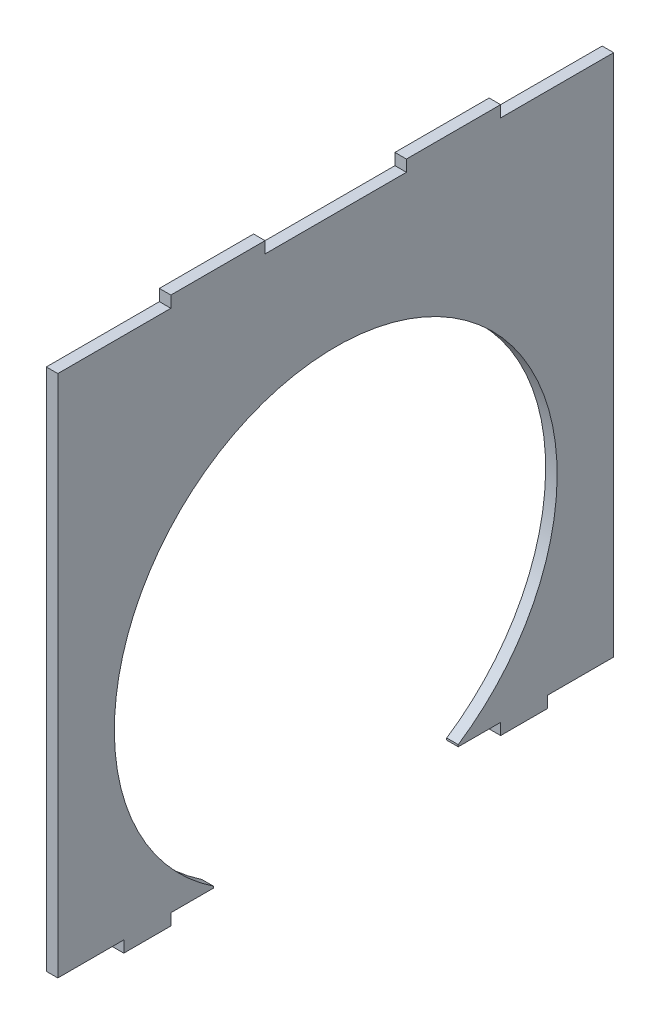
ISO-10303-21;
HEADER;
FILE_DESCRIPTION(('STEP AP214'),'2;1');
FILE_NAME('part.step','',(''),(''),'','','');
FILE_SCHEMA(('AUTOMOTIVE_DESIGN { 1 0 10303 214 1 1 1 1 }'));
ENDSEC;
DATA;
#1=APPLICATION_CONTEXT('core data for automotive mechanical design processes');
#2=APPLICATION_PROTOCOL_DEFINITION('international standard','automotive_design',2000,#1);
#3=PRODUCT_CONTEXT('',#1,'mechanical');
#4=PRODUCT('Part','Part','',(#3));
#5=PRODUCT_RELATED_PRODUCT_CATEGORY('part','',(#4));
#6=PRODUCT_DEFINITION_FORMATION('','',#4);
#7=PRODUCT_DEFINITION_CONTEXT('part definition',#1,'design');
#8=PRODUCT_DEFINITION('design','',#6,#7);
#9=PRODUCT_DEFINITION_SHAPE('','',#8);
#10=(LENGTH_UNIT() NAMED_UNIT(*) SI_UNIT(.MILLI.,.METRE.));
#11=(NAMED_UNIT(*) PLANE_ANGLE_UNIT() SI_UNIT($,.RADIAN.));
#12=(NAMED_UNIT(*) SI_UNIT($,.STERADIAN.) SOLID_ANGLE_UNIT());
#13=UNCERTAINTY_MEASURE_WITH_UNIT(LENGTH_MEASURE(1.E-05),#10,'distance_accuracy_value','');
#14=(GEOMETRIC_REPRESENTATION_CONTEXT(3) GLOBAL_UNCERTAINTY_ASSIGNED_CONTEXT((#13)) GLOBAL_UNIT_ASSIGNED_CONTEXT((#10,
#11,#12)) REPRESENTATION_CONTEXT('',''));
#15=CARTESIAN_POINT('',(0.,0.,0.));
#16=DIRECTION('',(0.,0.,1.));
#17=DIRECTION('',(1.,0.,0.));
#18=AXIS2_PLACEMENT_3D('',#15,#16,#17);
#19=CARTESIAN_POINT('',(2.44,55.56,-34.9999999999999));
#20=DIRECTION('',(0.,-1.,0.));
#21=DIRECTION('',(0.,0.,-1.));
#22=AXIS2_PLACEMENT_3D('',#19,#20,#21);
#23=PLANE('',#22);
#24=DIRECTION('',(0.,0.,1.));
#25=VECTOR('',#24,1.);
#26=CARTESIAN_POINT('',(0.,55.56,-34.9999999999999));
#27=LINE('',#26,#25);
#28=CARTESIAN_POINT('',(0.,55.56,-59.));
#29=VERTEX_POINT('',#28);
#30=CARTESIAN_POINT('',(0.,55.56,-34.9999999999999));
#31=VERTEX_POINT('',#30);
#32=EDGE_CURVE('E226',#29,#31,#27,.T.);
#33=ORIENTED_EDGE('',*,*,#32,.T.);
#34=DIRECTION('',(-1.,0.,0.));
#35=VECTOR('',#34,1.);
#36=CARTESIAN_POINT('',(2.44,55.56,-34.9999999999999));
#37=LINE('',#36,#35);
#38=CARTESIAN_POINT('',(2.44,55.56,-34.9999999999999));
#39=VERTEX_POINT('',#38);
#40=EDGE_CURVE('E11',#39,#31,#37,.T.);
#41=ORIENTED_EDGE('',*,*,#40,.F.);
#42=DIRECTION('',(0.,0.,1.));
#43=VECTOR('',#42,1.);
#44=CARTESIAN_POINT('',(2.44,55.56,-34.9999999999999));
#45=LINE('',#44,#43);
#46=CARTESIAN_POINT('',(2.44,55.56,-59.));
#47=VERTEX_POINT('',#46);
#48=EDGE_CURVE('E272',#47,#39,#45,.T.);
#49=ORIENTED_EDGE('',*,*,#48,.F.);
#50=DIRECTION('',(-1.,0.,0.));
#51=VECTOR('',#50,1.);
#52=CARTESIAN_POINT('',(2.44,55.56,-59.));
#53=LINE('',#52,#51);
#54=EDGE_CURVE('E222',#47,#29,#53,.T.);
#55=ORIENTED_EDGE('',*,*,#54,.T.);
#56=EDGE_LOOP('',(#33,#41,#49,#55));
#57=FACE_BOUND('',#56,.T.);
#58=ADVANCED_FACE('F34',(#57),#23,.F.);
#59=CARTESIAN_POINT('',(2.44,58.,-34.9999999999999));
#60=DIRECTION('',(0.,0.,1.));
#61=DIRECTION('',(1.,0.,0.));
#62=AXIS2_PLACEMENT_3D('',#59,#60,#61);
#63=PLANE('',#62);
#64=DIRECTION('',(0.,1.,0.));
#65=VECTOR('',#64,1.);
#66=CARTESIAN_POINT('',(0.,58.,-34.9999999999999));
#67=LINE('',#66,#65);
#68=CARTESIAN_POINT('',(0.,58.,-34.9999999999999));
#69=VERTEX_POINT('',#68);
#70=EDGE_CURVE('E229',#31,#69,#67,.T.);
#71=ORIENTED_EDGE('',*,*,#70,.T.);
#72=DIRECTION('',(-1.,0.,0.));
#73=VECTOR('',#72,1.);
#74=CARTESIAN_POINT('',(2.44,58.,-34.9999999999999));
#75=LINE('',#74,#73);
#76=CARTESIAN_POINT('',(2.44,58.,-34.9999999999999));
#77=VERTEX_POINT('',#76);
#78=EDGE_CURVE('E42',#77,#69,#75,.T.);
#79=ORIENTED_EDGE('',*,*,#78,.F.);
#80=DIRECTION('',(0.,1.,0.));
#81=VECTOR('',#80,1.);
#82=CARTESIAN_POINT('',(2.44,58.,-34.9999999999999));
#83=LINE('',#82,#81);
#84=EDGE_CURVE('E141',#39,#77,#83,.T.);
#85=ORIENTED_EDGE('',*,*,#84,.F.);
#86=ORIENTED_EDGE('',*,*,#40,.T.);
#87=EDGE_LOOP('',(#71,#79,#85,#86));
#88=FACE_BOUND('',#87,.T.);
#89=ADVANCED_FACE('F410',(#88),#63,.F.);
#90=CARTESIAN_POINT('',(2.44,58.,-34.9999999999999));
#91=DIRECTION('',(0.,-1.,0.));
#92=DIRECTION('',(0.,0.,-1.));
#93=AXIS2_PLACEMENT_3D('',#90,#91,#92);
#94=PLANE('',#93);
#95=DIRECTION('',(0.,0.,1.));
#96=VECTOR('',#95,1.);
#97=CARTESIAN_POINT('',(0.,58.,-34.9999999999999));
#98=LINE('',#97,#96);
#99=CARTESIAN_POINT('',(0.,58.,-14.9999999999999));
#100=VERTEX_POINT('',#99);
#101=EDGE_CURVE('E231',#69,#100,#98,.T.);
#102=ORIENTED_EDGE('',*,*,#101,.T.);
#103=DIRECTION('',(-1.,0.,0.));
#104=VECTOR('',#103,1.);
#105=CARTESIAN_POINT('',(2.44,58.,-14.9999999999999));
#106=LINE('',#105,#104);
#107=CARTESIAN_POINT('',(2.44,58.,-14.9999999999999));
#108=VERTEX_POINT('',#107);
#109=EDGE_CURVE('E327',#108,#100,#106,.T.);
#110=ORIENTED_EDGE('',*,*,#109,.F.);
#111=DIRECTION('',(0.,0.,1.));
#112=VECTOR('',#111,1.);
#113=CARTESIAN_POINT('',(2.44,58.,-34.9999999999999));
#114=LINE('',#113,#112);
#115=EDGE_CURVE('E335',#77,#108,#114,.T.);
#116=ORIENTED_EDGE('',*,*,#115,.F.);
#117=ORIENTED_EDGE('',*,*,#78,.T.);
#118=EDGE_LOOP('',(#102,#110,#116,#117));
#119=FACE_BOUND('',#118,.T.);
#120=ADVANCED_FACE('F333',(#119),#94,.F.);
#121=CARTESIAN_POINT('',(2.44,58.,-14.9999999999999));
#122=DIRECTION('',(0.,0.,-1.));
#123=DIRECTION('',(0.,1.,0.));
#124=AXIS2_PLACEMENT_3D('',#121,#122,#123);
#125=PLANE('',#124);
#126=DIRECTION('',(0.,-1.,0.));
#127=VECTOR('',#126,1.);
#128=CARTESIAN_POINT('',(0.,58.,-14.9999999999999));
#129=LINE('',#128,#127);
#130=CARTESIAN_POINT('',(0.,55.56,-14.9999999999999));
#131=VERTEX_POINT('',#130);
#132=EDGE_CURVE('E233',#100,#131,#129,.T.);
#133=ORIENTED_EDGE('',*,*,#132,.T.);
#134=DIRECTION('',(-1.,0.,0.));
#135=VECTOR('',#134,1.);
#136=CARTESIAN_POINT('',(2.44,55.56,-14.9999999999999));
#137=LINE('',#136,#135);
#138=CARTESIAN_POINT('',(2.44,55.56,-14.9999999999999));
#139=VERTEX_POINT('',#138);
#140=EDGE_CURVE('E324',#139,#131,#137,.T.);
#141=ORIENTED_EDGE('',*,*,#140,.F.);
#142=DIRECTION('',(0.,-1.,0.));
#143=VECTOR('',#142,1.);
#144=CARTESIAN_POINT('',(2.44,58.,-14.9999999999999));
#145=LINE('',#144,#143);
#146=EDGE_CURVE('E353',#108,#139,#145,.T.);
#147=ORIENTED_EDGE('',*,*,#146,.F.);
#148=ORIENTED_EDGE('',*,*,#109,.T.);
#149=EDGE_LOOP('',(#133,#141,#147,#148));
#150=FACE_BOUND('',#149,.T.);
#151=ADVANCED_FACE('F344',(#150),#125,.F.);
#152=CARTESIAN_POINT('',(2.44,55.56,15.));
#153=DIRECTION('',(0.,-1.,0.));
#154=DIRECTION('',(0.,0.,-1.));
#155=AXIS2_PLACEMENT_3D('',#152,#153,#154);
#156=PLANE('',#155);
#157=DIRECTION('',(0.,0.,1.));
#158=VECTOR('',#157,1.);
#159=CARTESIAN_POINT('',(0.,55.56,15.));
#160=LINE('',#159,#158);
#161=CARTESIAN_POINT('',(0.,55.56,15.));
#162=VERTEX_POINT('',#161);
#163=EDGE_CURVE('E235',#131,#162,#160,.T.);
#164=ORIENTED_EDGE('',*,*,#163,.T.);
#165=DIRECTION('',(-1.,0.,0.));
#166=VECTOR('',#165,1.);
#167=CARTESIAN_POINT('',(2.44,55.56,15.));
#168=LINE('',#167,#166);
#169=CARTESIAN_POINT('',(2.44,55.56,15.));
#170=VERTEX_POINT('',#169);
#171=EDGE_CURVE('E321',#170,#162,#168,.T.);
#172=ORIENTED_EDGE('',*,*,#171,.F.);
#173=DIRECTION('',(0.,0.,1.));
#174=VECTOR('',#173,1.);
#175=CARTESIAN_POINT('',(2.44,55.56,15.));
#176=LINE('',#175,#174);
#177=EDGE_CURVE('E350',#139,#170,#176,.T.);
#178=ORIENTED_EDGE('',*,*,#177,.F.);
#179=ORIENTED_EDGE('',*,*,#140,.T.);
#180=EDGE_LOOP('',(#164,#172,#178,#179));
#181=FACE_BOUND('',#180,.T.);
#182=ADVANCED_FACE('F348',(#181),#156,.F.);
#183=CARTESIAN_POINT('',(2.44,58.,15.));
#184=DIRECTION('',(0.,0.,1.));
#185=DIRECTION('',(0.,-1.,0.));
#186=AXIS2_PLACEMENT_3D('',#183,#184,#185);
#187=PLANE('',#186);
#188=DIRECTION('',(0.,1.,0.));
#189=VECTOR('',#188,1.);
#190=CARTESIAN_POINT('',(0.,58.,15.));
#191=LINE('',#190,#189);
#192=CARTESIAN_POINT('',(0.,58.,15.));
#193=VERTEX_POINT('',#192);
#194=EDGE_CURVE('E237',#162,#193,#191,.T.);
#195=ORIENTED_EDGE('',*,*,#194,.T.);
#196=DIRECTION('',(-1.,0.,0.));
#197=VECTOR('',#196,1.);
#198=CARTESIAN_POINT('',(2.44,58.,15.));
#199=LINE('',#198,#197);
#200=CARTESIAN_POINT('',(2.44,58.,15.));
#201=VERTEX_POINT('',#200);
#202=EDGE_CURVE('E318',#201,#193,#199,.T.);
#203=ORIENTED_EDGE('',*,*,#202,.F.);
#204=DIRECTION('',(0.,1.,0.));
#205=VECTOR('',#204,1.);
#206=CARTESIAN_POINT('',(2.44,58.,15.));
#207=LINE('',#206,#205);
#208=EDGE_CURVE('E352',#170,#201,#207,.T.);
#209=ORIENTED_EDGE('',*,*,#208,.F.);
#210=ORIENTED_EDGE('',*,*,#171,.T.);
#211=EDGE_LOOP('',(#195,#203,#209,#210));
#212=FACE_BOUND('',#211,.T.);
#213=ADVANCED_FACE('F423',(#212),#187,.F.);
#214=CARTESIAN_POINT('',(2.44,58.,35.));
#215=DIRECTION('',(0.,-1.,0.));
#216=DIRECTION('',(0.,0.,-1.));
#217=AXIS2_PLACEMENT_3D('',#214,#215,#216);
#218=PLANE('',#217);
#219=DIRECTION('',(0.,0.,1.));
#220=VECTOR('',#219,1.);
#221=CARTESIAN_POINT('',(0.,58.,35.));
#222=LINE('',#221,#220);
#223=CARTESIAN_POINT('',(0.,58.,35.));
#224=VERTEX_POINT('',#223);
#225=EDGE_CURVE('E239',#193,#224,#222,.T.);
#226=ORIENTED_EDGE('',*,*,#225,.T.);
#227=DIRECTION('',(-1.,0.,0.));
#228=VECTOR('',#227,1.);
#229=CARTESIAN_POINT('',(2.44,58.,35.));
#230=LINE('',#229,#228);
#231=CARTESIAN_POINT('',(2.44,58.,35.));
#232=VERTEX_POINT('',#231);
#233=EDGE_CURVE('E315',#232,#224,#230,.T.);
#234=ORIENTED_EDGE('',*,*,#233,.F.);
#235=DIRECTION('',(0.,0.,1.));
#236=VECTOR('',#235,1.);
#237=CARTESIAN_POINT('',(2.44,58.,35.));
#238=LINE('',#237,#236);
#239=EDGE_CURVE('E355',#201,#232,#238,.T.);
#240=ORIENTED_EDGE('',*,*,#239,.F.);
#241=ORIENTED_EDGE('',*,*,#202,.T.);
#242=EDGE_LOOP('',(#226,#234,#240,#241));
#243=FACE_BOUND('',#242,.T.);
#244=ADVANCED_FACE('F426',(#243),#218,.F.);
#245=CARTESIAN_POINT('',(2.44,58.,35.));
#246=DIRECTION('',(0.,0.,-1.));
#247=DIRECTION('',(-1.,0.,0.));
#248=AXIS2_PLACEMENT_3D('',#245,#246,#247);
#249=PLANE('',#248);
#250=DIRECTION('',(0.,-1.,0.));
#251=VECTOR('',#250,1.);
#252=CARTESIAN_POINT('',(0.,58.,35.));
#253=LINE('',#252,#251);
#254=CARTESIAN_POINT('',(0.,55.56,35.));
#255=VERTEX_POINT('',#254);
#256=EDGE_CURVE('E241',#224,#255,#253,.T.);
#257=ORIENTED_EDGE('',*,*,#256,.T.);
#258=DIRECTION('',(-1.,0.,0.));
#259=VECTOR('',#258,1.);
#260=CARTESIAN_POINT('',(2.44,55.56,35.));
#261=LINE('',#260,#259);
#262=CARTESIAN_POINT('',(2.44,55.56,35.));
#263=VERTEX_POINT('',#262);
#264=EDGE_CURVE('E312',#263,#255,#261,.T.);
#265=ORIENTED_EDGE('',*,*,#264,.F.);
#266=DIRECTION('',(0.,-1.,0.));
#267=VECTOR('',#266,1.);
#268=CARTESIAN_POINT('',(2.44,58.,35.));
#269=LINE('',#268,#267);
#270=EDGE_CURVE('E361',#232,#263,#269,.T.);
#271=ORIENTED_EDGE('',*,*,#270,.F.);
#272=ORIENTED_EDGE('',*,*,#233,.T.);
#273=EDGE_LOOP('',(#257,#265,#271,#272));
#274=FACE_BOUND('',#273,.T.);
#275=ADVANCED_FACE('F430',(#274),#249,.F.);
#276=CARTESIAN_POINT('',(2.44,55.56,59.));
#277=DIRECTION('',(0.,-1.,0.));
#278=DIRECTION('',(0.,0.,-1.));
#279=AXIS2_PLACEMENT_3D('',#276,#277,#278);
#280=PLANE('',#279);
#281=DIRECTION('',(0.,0.,1.));
#282=VECTOR('',#281,1.);
#283=CARTESIAN_POINT('',(0.,55.56,59.));
#284=LINE('',#283,#282);
#285=CARTESIAN_POINT('',(0.,55.56,59.));
#286=VERTEX_POINT('',#285);
#287=EDGE_CURVE('E243',#255,#286,#284,.T.);
#288=ORIENTED_EDGE('',*,*,#287,.T.);
#289=DIRECTION('',(-1.,0.,0.));
#290=VECTOR('',#289,1.);
#291=CARTESIAN_POINT('',(2.44,55.56,59.));
#292=LINE('',#291,#290);
#293=CARTESIAN_POINT('',(2.44,55.56,59.));
#294=VERTEX_POINT('',#293);
#295=EDGE_CURVE('E309',#294,#286,#292,.T.);
#296=ORIENTED_EDGE('',*,*,#295,.F.);
#297=DIRECTION('',(0.,0.,1.));
#298=VECTOR('',#297,1.);
#299=CARTESIAN_POINT('',(2.44,55.56,59.));
#300=LINE('',#299,#298);
#301=EDGE_CURVE('E363',#263,#294,#300,.T.);
#302=ORIENTED_EDGE('',*,*,#301,.F.);
#303=ORIENTED_EDGE('',*,*,#264,.T.);
#304=EDGE_LOOP('',(#288,#296,#302,#303));
#305=FACE_BOUND('',#304,.T.);
#306=ADVANCED_FACE('F434',(#305),#280,.F.);
#307=CARTESIAN_POINT('',(2.44,-55.56,59.));
#308=DIRECTION('',(0.,0.,-1.));
#309=DIRECTION('',(-1.,0.,0.));
#310=AXIS2_PLACEMENT_3D('',#307,#308,#309);
#311=PLANE('',#310);
#312=DIRECTION('',(0.,-1.,0.));
#313=VECTOR('',#312,1.);
#314=CARTESIAN_POINT('',(0.,-55.56,59.));
#315=LINE('',#314,#313);
#316=CARTESIAN_POINT('',(0.,-55.56,59.));
#317=VERTEX_POINT('',#316);
#318=EDGE_CURVE('E245',#286,#317,#315,.T.);
#319=ORIENTED_EDGE('',*,*,#318,.T.);
#320=DIRECTION('',(-1.,0.,0.));
#321=VECTOR('',#320,1.);
#322=CARTESIAN_POINT('',(2.44,-55.56,59.));
#323=LINE('',#322,#321);
#324=CARTESIAN_POINT('',(2.44,-55.56,59.));
#325=VERTEX_POINT('',#324);
#326=EDGE_CURVE('E306',#325,#317,#323,.T.);
#327=ORIENTED_EDGE('',*,*,#326,.F.);
#328=DIRECTION('',(0.,-1.,0.));
#329=VECTOR('',#328,1.);
#330=CARTESIAN_POINT('',(2.44,-55.56,59.));
#331=LINE('',#330,#329);
#332=EDGE_CURVE('E365',#294,#325,#331,.T.);
#333=ORIENTED_EDGE('',*,*,#332,.F.);
#334=ORIENTED_EDGE('',*,*,#295,.T.);
#335=EDGE_LOOP('',(#319,#327,#333,#334));
#336=FACE_BOUND('',#335,.T.);
#337=ADVANCED_FACE('F438',(#336),#311,.F.);
#338=CARTESIAN_POINT('',(2.44,-55.56,59.));
#339=DIRECTION('',(0.,1.,0.));
#340=DIRECTION('',(0.,0.,1.));
#341=AXIS2_PLACEMENT_3D('',#338,#339,#340);
#342=PLANE('',#341);
#343=DIRECTION('',(0.,0.,-1.));
#344=VECTOR('',#343,1.);
#345=CARTESIAN_POINT('',(0.,-55.56,59.));
#346=LINE('',#345,#344);
#347=CARTESIAN_POINT('',(0.,-55.56,45.));
#348=VERTEX_POINT('',#347);
#349=EDGE_CURVE('E247',#317,#348,#346,.T.);
#350=ORIENTED_EDGE('',*,*,#349,.T.);
#351=DIRECTION('',(-1.,0.,0.));
#352=VECTOR('',#351,1.);
#353=CARTESIAN_POINT('',(2.44,-55.56,45.));
#354=LINE('',#353,#352);
#355=CARTESIAN_POINT('',(2.44,-55.56,45.));
#356=VERTEX_POINT('',#355);
#357=EDGE_CURVE('E303',#356,#348,#354,.T.);
#358=ORIENTED_EDGE('',*,*,#357,.F.);
#359=DIRECTION('',(0.,0.,-1.));
#360=VECTOR('',#359,1.);
#361=CARTESIAN_POINT('',(2.44,-55.56,59.));
#362=LINE('',#361,#360);
#363=EDGE_CURVE('E367',#325,#356,#362,.T.);
#364=ORIENTED_EDGE('',*,*,#363,.F.);
#365=ORIENTED_EDGE('',*,*,#326,.T.);
#366=EDGE_LOOP('',(#350,#358,#364,#365));
#367=FACE_BOUND('',#366,.T.);
#368=ADVANCED_FACE('F442',(#367),#342,.F.);
#369=CARTESIAN_POINT('',(2.44,-58.,45.));
#370=DIRECTION('',(0.,0.,-1.));
#371=DIRECTION('',(-1.,0.,0.));
#372=AXIS2_PLACEMENT_3D('',#369,#370,#371);
#373=PLANE('',#372);
#374=DIRECTION('',(0.,-1.,0.));
#375=VECTOR('',#374,1.);
#376=CARTESIAN_POINT('',(0.,-58.,45.));
#377=LINE('',#376,#375);
#378=CARTESIAN_POINT('',(0.,-58.,45.));
#379=VERTEX_POINT('',#378);
#380=EDGE_CURVE('E249',#348,#379,#377,.T.);
#381=ORIENTED_EDGE('',*,*,#380,.T.);
#382=DIRECTION('',(-1.,0.,0.));
#383=VECTOR('',#382,1.);
#384=CARTESIAN_POINT('',(2.44,-58.,45.));
#385=LINE('',#384,#383);
#386=CARTESIAN_POINT('',(2.44,-58.,45.));
#387=VERTEX_POINT('',#386);
#388=EDGE_CURVE('E300',#387,#379,#385,.T.);
#389=ORIENTED_EDGE('',*,*,#388,.F.);
#390=DIRECTION('',(0.,-1.,0.));
#391=VECTOR('',#390,1.);
#392=CARTESIAN_POINT('',(2.44,-58.,45.));
#393=LINE('',#392,#391);
#394=EDGE_CURVE('E369',#356,#387,#393,.T.);
#395=ORIENTED_EDGE('',*,*,#394,.F.);
#396=ORIENTED_EDGE('',*,*,#357,.T.);
#397=EDGE_LOOP('',(#381,#389,#395,#396));
#398=FACE_BOUND('',#397,.T.);
#399=ADVANCED_FACE('F446',(#398),#373,.F.);
#400=CARTESIAN_POINT('',(2.44,-58.,35.));
#401=DIRECTION('',(0.,1.,0.));
#402=DIRECTION('',(0.,0.,1.));
#403=AXIS2_PLACEMENT_3D('',#400,#401,#402);
#404=PLANE('',#403);
#405=DIRECTION('',(0.,0.,-1.));
#406=VECTOR('',#405,1.);
#407=CARTESIAN_POINT('',(0.,-58.,35.));
#408=LINE('',#407,#406);
#409=CARTESIAN_POINT('',(0.,-58.,35.));
#410=VERTEX_POINT('',#409);
#411=EDGE_CURVE('E251',#379,#410,#408,.T.);
#412=ORIENTED_EDGE('',*,*,#411,.T.);
#413=DIRECTION('',(-1.,0.,0.));
#414=VECTOR('',#413,1.);
#415=CARTESIAN_POINT('',(2.44,-58.,35.));
#416=LINE('',#415,#414);
#417=CARTESIAN_POINT('',(2.44,-58.,35.));
#418=VERTEX_POINT('',#417);
#419=EDGE_CURVE('E297',#418,#410,#416,.T.);
#420=ORIENTED_EDGE('',*,*,#419,.F.);
#421=DIRECTION('',(0.,0.,-1.));
#422=VECTOR('',#421,1.);
#423=CARTESIAN_POINT('',(2.44,-58.,35.));
#424=LINE('',#423,#422);
#425=EDGE_CURVE('E371',#387,#418,#424,.T.);
#426=ORIENTED_EDGE('',*,*,#425,.F.);
#427=ORIENTED_EDGE('',*,*,#388,.T.);
#428=EDGE_LOOP('',(#412,#420,#426,#427));
#429=FACE_BOUND('',#428,.T.);
#430=ADVANCED_FACE('F450',(#429),#404,.F.);
#431=CARTESIAN_POINT('',(2.44,-58.,35.));
#432=DIRECTION('',(0.,0.,1.));
#433=DIRECTION('',(1.,0.,0.));
#434=AXIS2_PLACEMENT_3D('',#431,#432,#433);
#435=PLANE('',#434);
#436=DIRECTION('',(0.,1.,0.));
#437=VECTOR('',#436,1.);
#438=CARTESIAN_POINT('',(0.,-58.,35.));
#439=LINE('',#438,#437);
#440=CARTESIAN_POINT('',(0.,-55.56,35.));
#441=VERTEX_POINT('',#440);
#442=EDGE_CURVE('E253',#410,#441,#439,.T.);
#443=ORIENTED_EDGE('',*,*,#442,.T.);
#444=DIRECTION('',(-1.,0.,0.));
#445=VECTOR('',#444,1.);
#446=CARTESIAN_POINT('',(2.44,-55.56,35.));
#447=LINE('',#446,#445);
#448=CARTESIAN_POINT('',(2.44,-55.56,35.));
#449=VERTEX_POINT('',#448);
#450=EDGE_CURVE('E294',#449,#441,#447,.T.);
#451=ORIENTED_EDGE('',*,*,#450,.F.);
#452=DIRECTION('',(0.,1.,0.));
#453=VECTOR('',#452,1.);
#454=CARTESIAN_POINT('',(2.44,-58.,35.));
#455=LINE('',#454,#453);
#456=EDGE_CURVE('E373',#418,#449,#455,.T.);
#457=ORIENTED_EDGE('',*,*,#456,.F.);
#458=ORIENTED_EDGE('',*,*,#419,.T.);
#459=EDGE_LOOP('',(#443,#451,#457,#458));
#460=FACE_BOUND('',#459,.T.);
#461=ADVANCED_FACE('F454',(#460),#435,.F.);
#462=CARTESIAN_POINT('',(2.44,-55.56,35.));
#463=DIRECTION('',(0.,1.,0.));
#464=DIRECTION('',(0.,0.,1.));
#465=AXIS2_PLACEMENT_3D('',#462,#463,#464);
#466=PLANE('',#465);
#467=DIRECTION('',(0.,0.,-1.));
#468=VECTOR('',#467,1.);
#469=CARTESIAN_POINT('',(0.,-55.56,35.));
#470=LINE('',#469,#468);
#471=CARTESIAN_POINT('',(0.,-55.56,26.));
#472=VERTEX_POINT('',#471);
#473=EDGE_CURVE('E255',#441,#472,#470,.T.);
#474=ORIENTED_EDGE('',*,*,#473,.T.);
#475=DIRECTION('',(-1.,0.,0.));
#476=VECTOR('',#475,1.);
#477=CARTESIAN_POINT('',(2.44,-55.56,26.));
#478=LINE('',#477,#476);
#479=CARTESIAN_POINT('',(2.44,-55.56,26.));
#480=VERTEX_POINT('',#479);
#481=EDGE_CURVE('E291',#480,#472,#478,.T.);
#482=ORIENTED_EDGE('',*,*,#481,.F.);
#483=DIRECTION('',(0.,0.,-1.));
#484=VECTOR('',#483,1.);
#485=CARTESIAN_POINT('',(2.44,-55.56,35.));
#486=LINE('',#485,#484);
#487=EDGE_CURVE('E375',#449,#480,#486,.T.);
#488=ORIENTED_EDGE('',*,*,#487,.F.);
#489=ORIENTED_EDGE('',*,*,#450,.T.);
#490=EDGE_LOOP('',(#474,#482,#488,#489));
#491=FACE_BOUND('',#490,.T.);
#492=ADVANCED_FACE('F458',(#491),#466,.F.);
#493=CARTESIAN_POINT('',(2.44,-55.56,26.));
#494=DIRECTION('',(0.,0.,1.));
#495=DIRECTION('',(0.,-1.,0.));
#496=AXIS2_PLACEMENT_3D('',#493,#494,#495);
#497=PLANE('',#496);
#498=DIRECTION('',(0.,1.,0.));
#499=VECTOR('',#498,1.);
#500=CARTESIAN_POINT('',(0.,-55.56,26.));
#501=LINE('',#500,#499);
#502=CARTESIAN_POINT('',(0.,-55.1535439009038,26.));
#503=VERTEX_POINT('',#502);
#504=EDGE_CURVE('E257',#472,#503,#501,.T.);
#505=ORIENTED_EDGE('',*,*,#504,.T.);
#506=DIRECTION('',(-1.,0.,0.));
#507=VECTOR('',#506,1.);
#508=CARTESIAN_POINT('',(2.44,-55.1535439009038,26.));
#509=LINE('',#508,#507);
#510=CARTESIAN_POINT('',(2.44,-55.1535439009038,26.));
#511=VERTEX_POINT('',#510);
#512=EDGE_CURVE('E288',#511,#503,#509,.T.);
#513=ORIENTED_EDGE('',*,*,#512,.F.);
#514=DIRECTION('',(0.,1.,0.));
#515=VECTOR('',#514,1.);
#516=CARTESIAN_POINT('',(2.44,-55.56,26.));
#517=LINE('',#516,#515);
#518=EDGE_CURVE('E377',#480,#511,#517,.T.);
#519=ORIENTED_EDGE('',*,*,#518,.F.);
#520=ORIENTED_EDGE('',*,*,#481,.T.);
#521=EDGE_LOOP('',(#505,#513,#519,#520));
#522=FACE_BOUND('',#521,.T.);
#523=ADVANCED_FACE('F462',(#522),#497,.F.);
#524=CARTESIAN_POINT('',(2.44,-16.,0.));
#525=DIRECTION('',(-1.,0.,0.));
#526=DIRECTION('',(0.,0.,1.));
#527=AXIS2_PLACEMENT_3D('',#524,#525,#526);
#528=CYLINDRICAL_SURFACE('',#527,47.);
#529=CARTESIAN_POINT('',(0.,-16.,0.));
#530=DIRECTION('',(-1.,0.,0.));
#531=DIRECTION('',(0.,0.,-1.));
#532=AXIS2_PLACEMENT_3D('',#529,#530,#531);
#533=CIRCLE('',#532,47.);
#534=CARTESIAN_POINT('',(0.,-55.1535439009038,-26.));
#535=VERTEX_POINT('',#534);
#536=EDGE_CURVE('E259',#503,#535,#533,.T.);
#537=ORIENTED_EDGE('',*,*,#536,.T.);
#538=DIRECTION('',(-1.,0.,0.));
#539=VECTOR('',#538,1.);
#540=CARTESIAN_POINT('',(2.44,-55.1535439009038,-26.));
#541=LINE('',#540,#539);
#542=CARTESIAN_POINT('',(2.44,-55.1535439009038,-26.));
#543=VERTEX_POINT('',#542);
#544=EDGE_CURVE('E285',#543,#535,#541,.T.);
#545=ORIENTED_EDGE('',*,*,#544,.F.);
#546=CARTESIAN_POINT('',(2.44,-16.,0.));
#547=DIRECTION('',(-1.,0.,0.));
#548=DIRECTION('',(0.,0.,-1.));
#549=AXIS2_PLACEMENT_3D('',#546,#547,#548);
#550=CIRCLE('',#549,47.);
#551=EDGE_CURVE('E379',#511,#543,#550,.T.);
#552=ORIENTED_EDGE('',*,*,#551,.F.);
#553=ORIENTED_EDGE('',*,*,#512,.T.);
#554=EDGE_LOOP('',(#537,#545,#552,#553));
#555=FACE_BOUND('',#554,.T.);
#556=ADVANCED_FACE('F466',(#555),#528,.F.);
#557=CARTESIAN_POINT('',(2.44,-55.56,-26.));
#558=DIRECTION('',(0.,0.,-1.));
#559=DIRECTION('',(0.,1.,0.));
#560=AXIS2_PLACEMENT_3D('',#557,#558,#559);
#561=PLANE('',#560);
#562=DIRECTION('',(0.,-1.,0.));
#563=VECTOR('',#562,1.);
#564=CARTESIAN_POINT('',(0.,-55.56,-26.));
#565=LINE('',#564,#563);
#566=CARTESIAN_POINT('',(0.,-55.56,-26.));
#567=VERTEX_POINT('',#566);
#568=EDGE_CURVE('E261',#535,#567,#565,.T.);
#569=ORIENTED_EDGE('',*,*,#568,.T.);
#570=DIRECTION('',(-1.,0.,0.));
#571=VECTOR('',#570,1.);
#572=CARTESIAN_POINT('',(2.44,-55.56,-26.));
#573=LINE('',#572,#571);
#574=CARTESIAN_POINT('',(2.44,-55.56,-26.));
#575=VERTEX_POINT('',#574);
#576=EDGE_CURVE('E282',#575,#567,#573,.T.);
#577=ORIENTED_EDGE('',*,*,#576,.F.);
#578=DIRECTION('',(0.,-1.,0.));
#579=VECTOR('',#578,1.);
#580=CARTESIAN_POINT('',(2.44,-55.56,-26.));
#581=LINE('',#580,#579);
#582=EDGE_CURVE('E381',#543,#575,#581,.T.);
#583=ORIENTED_EDGE('',*,*,#582,.F.);
#584=ORIENTED_EDGE('',*,*,#544,.T.);
#585=EDGE_LOOP('',(#569,#577,#583,#584));
#586=FACE_BOUND('',#585,.T.);
#587=ADVANCED_FACE('F470',(#586),#561,.F.);
#588=CARTESIAN_POINT('',(2.44,-55.56,-26.));
#589=DIRECTION('',(0.,1.,0.));
#590=DIRECTION('',(0.,0.,1.));
#591=AXIS2_PLACEMENT_3D('',#588,#589,#590);
#592=PLANE('',#591);
#593=DIRECTION('',(0.,0.,-1.));
#594=VECTOR('',#593,1.);
#595=CARTESIAN_POINT('',(0.,-55.56,-26.));
#596=LINE('',#595,#594);
#597=CARTESIAN_POINT('',(0.,-55.56,-35.));
#598=VERTEX_POINT('',#597);
#599=EDGE_CURVE('E263',#567,#598,#596,.T.);
#600=ORIENTED_EDGE('',*,*,#599,.T.);
#601=DIRECTION('',(-1.,0.,0.));
#602=VECTOR('',#601,1.);
#603=CARTESIAN_POINT('',(2.44,-55.56,-35.));
#604=LINE('',#603,#602);
#605=CARTESIAN_POINT('',(2.44,-55.56,-35.));
#606=VERTEX_POINT('',#605);
#607=EDGE_CURVE('E279',#606,#598,#604,.T.);
#608=ORIENTED_EDGE('',*,*,#607,.F.);
#609=DIRECTION('',(0.,0.,-1.));
#610=VECTOR('',#609,1.);
#611=CARTESIAN_POINT('',(2.44,-55.56,-26.));
#612=LINE('',#611,#610);
#613=EDGE_CURVE('E383',#575,#606,#612,.T.);
#614=ORIENTED_EDGE('',*,*,#613,.F.);
#615=ORIENTED_EDGE('',*,*,#576,.T.);
#616=EDGE_LOOP('',(#600,#608,#614,#615));
#617=FACE_BOUND('',#616,.T.);
#618=ADVANCED_FACE('F474',(#617),#592,.F.);
#619=CARTESIAN_POINT('',(2.44,-58.,-35.));
#620=DIRECTION('',(0.,0.,-1.));
#621=DIRECTION('',(-1.,0.,0.));
#622=AXIS2_PLACEMENT_3D('',#619,#620,#621);
#623=PLANE('',#622);
#624=DIRECTION('',(0.,-1.,0.));
#625=VECTOR('',#624,1.);
#626=CARTESIAN_POINT('',(0.,-58.,-35.));
#627=LINE('',#626,#625);
#628=CARTESIAN_POINT('',(0.,-58.,-35.));
#629=VERTEX_POINT('',#628);
#630=EDGE_CURVE('E265',#598,#629,#627,.T.);
#631=ORIENTED_EDGE('',*,*,#630,.T.);
#632=DIRECTION('',(-1.,0.,0.));
#633=VECTOR('',#632,1.);
#634=CARTESIAN_POINT('',(2.44,-58.,-35.));
#635=LINE('',#634,#633);
#636=CARTESIAN_POINT('',(2.44,-58.,-35.));
#637=VERTEX_POINT('',#636);
#638=EDGE_CURVE('E276',#637,#629,#635,.T.);
#639=ORIENTED_EDGE('',*,*,#638,.F.);
#640=DIRECTION('',(0.,-1.,0.));
#641=VECTOR('',#640,1.);
#642=CARTESIAN_POINT('',(2.44,-58.,-35.));
#643=LINE('',#642,#641);
#644=EDGE_CURVE('E385',#606,#637,#643,.T.);
#645=ORIENTED_EDGE('',*,*,#644,.F.);
#646=ORIENTED_EDGE('',*,*,#607,.T.);
#647=EDGE_LOOP('',(#631,#639,#645,#646));
#648=FACE_BOUND('',#647,.T.);
#649=ADVANCED_FACE('F391',(#648),#623,.F.);
#650=CARTESIAN_POINT('',(2.44,-58.,-35.));
#651=DIRECTION('',(0.,1.,0.));
#652=DIRECTION('',(0.,0.,1.));
#653=AXIS2_PLACEMENT_3D('',#650,#651,#652);
#654=PLANE('',#653);
#655=DIRECTION('',(0.,0.,-1.));
#656=VECTOR('',#655,1.);
#657=CARTESIAN_POINT('',(0.,-58.,-35.));
#658=LINE('',#657,#656);
#659=CARTESIAN_POINT('',(0.,-58.,-45.));
#660=VERTEX_POINT('',#659);
#661=EDGE_CURVE('E267',#629,#660,#658,.T.);
#662=ORIENTED_EDGE('',*,*,#661,.T.);
#663=DIRECTION('',(-1.,0.,0.));
#664=VECTOR('',#663,1.);
#665=CARTESIAN_POINT('',(2.44,-58.,-45.));
#666=LINE('',#665,#664);
#667=CARTESIAN_POINT('',(2.44,-58.,-45.));
#668=VERTEX_POINT('',#667);
#669=EDGE_CURVE('E217',#668,#660,#666,.T.);
#670=ORIENTED_EDGE('',*,*,#669,.F.);
#671=DIRECTION('',(0.,0.,-1.));
#672=VECTOR('',#671,1.);
#673=CARTESIAN_POINT('',(2.44,-58.,-35.));
#674=LINE('',#673,#672);
#675=EDGE_CURVE('E208',#637,#668,#674,.T.);
#676=ORIENTED_EDGE('',*,*,#675,.F.);
#677=ORIENTED_EDGE('',*,*,#638,.T.);
#678=EDGE_LOOP('',(#662,#670,#676,#677));
#679=FACE_BOUND('',#678,.T.);
#680=ADVANCED_FACE('F395',(#679),#654,.F.);
#681=CARTESIAN_POINT('',(2.44,-58.,-45.));
#682=DIRECTION('',(0.,0.,1.));
#683=DIRECTION('',(1.,0.,0.));
#684=AXIS2_PLACEMENT_3D('',#681,#682,#683);
#685=PLANE('',#684);
#686=DIRECTION('',(0.,1.,0.));
#687=VECTOR('',#686,1.);
#688=CARTESIAN_POINT('',(0.,-58.,-45.));
#689=LINE('',#688,#687);
#690=CARTESIAN_POINT('',(0.,-55.56,-45.));
#691=VERTEX_POINT('',#690);
#692=EDGE_CURVE('E216',#660,#691,#689,.T.);
#693=ORIENTED_EDGE('',*,*,#692,.T.);
#694=DIRECTION('',(-1.,0.,0.));
#695=VECTOR('',#694,1.);
#696=CARTESIAN_POINT('',(2.44,-55.56,-45.));
#697=LINE('',#696,#695);
#698=CARTESIAN_POINT('',(2.44,-55.56,-45.));
#699=VERTEX_POINT('',#698);
#700=EDGE_CURVE('E213',#699,#691,#697,.T.);
#701=ORIENTED_EDGE('',*,*,#700,.F.);
#702=DIRECTION('',(0.,1.,0.));
#703=VECTOR('',#702,1.);
#704=CARTESIAN_POINT('',(2.44,-58.,-45.));
#705=LINE('',#704,#703);
#706=EDGE_CURVE('E202',#668,#699,#705,.T.);
#707=ORIENTED_EDGE('',*,*,#706,.F.);
#708=ORIENTED_EDGE('',*,*,#669,.T.);
#709=EDGE_LOOP('',(#693,#701,#707,#708));
#710=FACE_BOUND('',#709,.T.);
#711=ADVANCED_FACE('F214',(#710),#685,.F.);
#712=CARTESIAN_POINT('',(2.44,-55.56,-45.));
#713=DIRECTION('',(0.,1.,0.));
#714=DIRECTION('',(0.,0.,1.));
#715=AXIS2_PLACEMENT_3D('',#712,#713,#714);
#716=PLANE('',#715);
#717=DIRECTION('',(0.,0.,-1.));
#718=VECTOR('',#717,1.);
#719=CARTESIAN_POINT('',(0.,-55.56,-45.));
#720=LINE('',#719,#718);
#721=CARTESIAN_POINT('',(0.,-55.56,-59.));
#722=VERTEX_POINT('',#721);
#723=EDGE_CURVE('E127',#691,#722,#720,.T.);
#724=ORIENTED_EDGE('',*,*,#723,.T.);
#725=DIRECTION('',(-1.,0.,0.));
#726=VECTOR('',#725,1.);
#727=CARTESIAN_POINT('',(2.44,-55.56,-59.));
#728=LINE('',#727,#726);
#729=CARTESIAN_POINT('',(2.44,-55.56,-59.));
#730=VERTEX_POINT('',#729);
#731=EDGE_CURVE('E218',#730,#722,#728,.T.);
#732=ORIENTED_EDGE('',*,*,#731,.F.);
#733=DIRECTION('',(0.,0.,-1.));
#734=VECTOR('',#733,1.);
#735=CARTESIAN_POINT('',(2.44,-55.56,-45.));
#736=LINE('',#735,#734);
#737=EDGE_CURVE('E206',#699,#730,#736,.T.);
#738=ORIENTED_EDGE('',*,*,#737,.F.);
#739=ORIENTED_EDGE('',*,*,#700,.T.);
#740=EDGE_LOOP('',(#724,#732,#738,#739));
#741=FACE_BOUND('',#740,.T.);
#742=ADVANCED_FACE('F220',(#741),#716,.F.);
#743=CARTESIAN_POINT('',(2.44,-55.56,-59.));
#744=DIRECTION('',(0.,0.,1.));
#745=DIRECTION('',(1.,0.,0.));
#746=AXIS2_PLACEMENT_3D('',#743,#744,#745);
#747=PLANE('',#746);
#748=DIRECTION('',(0.,1.,0.));
#749=VECTOR('',#748,1.);
#750=CARTESIAN_POINT('',(0.,-55.56,-59.));
#751=LINE('',#750,#749);
#752=EDGE_CURVE('E133',#722,#29,#751,.T.);
#753=ORIENTED_EDGE('',*,*,#752,.T.);
#754=ORIENTED_EDGE('',*,*,#54,.F.);
#755=DIRECTION('',(0.,1.,0.));
#756=VECTOR('',#755,1.);
#757=CARTESIAN_POINT('',(2.44,-55.56,-59.));
#758=LINE('',#757,#756);
#759=EDGE_CURVE('E50',#730,#47,#758,.T.);
#760=ORIENTED_EDGE('',*,*,#759,.F.);
#761=ORIENTED_EDGE('',*,*,#731,.T.);
#762=EDGE_LOOP('',(#753,#754,#760,#761));
#763=FACE_BOUND('',#762,.T.);
#764=ADVANCED_FACE('F399',(#763),#747,.F.);
#765=CARTESIAN_POINT('',(2.44,-16.,0.));
#766=DIRECTION('',(1.,0.,0.));
#767=DIRECTION('',(0.,0.,-1.));
#768=AXIS2_PLACEMENT_3D('',#765,#766,#767);
#769=PLANE('',#768);
#770=ORIENTED_EDGE('',*,*,#48,.T.);
#771=ORIENTED_EDGE('',*,*,#84,.T.);
#772=ORIENTED_EDGE('',*,*,#115,.T.);
#773=ORIENTED_EDGE('',*,*,#146,.T.);
#774=ORIENTED_EDGE('',*,*,#177,.T.);
#775=ORIENTED_EDGE('',*,*,#208,.T.);
#776=ORIENTED_EDGE('',*,*,#239,.T.);
#777=ORIENTED_EDGE('',*,*,#270,.T.);
#778=ORIENTED_EDGE('',*,*,#301,.T.);
#779=ORIENTED_EDGE('',*,*,#332,.T.);
#780=ORIENTED_EDGE('',*,*,#363,.T.);
#781=ORIENTED_EDGE('',*,*,#394,.T.);
#782=ORIENTED_EDGE('',*,*,#425,.T.);
#783=ORIENTED_EDGE('',*,*,#456,.T.);
#784=ORIENTED_EDGE('',*,*,#487,.T.);
#785=ORIENTED_EDGE('',*,*,#518,.T.);
#786=ORIENTED_EDGE('',*,*,#551,.T.);
#787=ORIENTED_EDGE('',*,*,#582,.T.);
#788=ORIENTED_EDGE('',*,*,#613,.T.);
#789=ORIENTED_EDGE('',*,*,#644,.T.);
#790=ORIENTED_EDGE('',*,*,#675,.T.);
#791=ORIENTED_EDGE('',*,*,#706,.T.);
#792=ORIENTED_EDGE('',*,*,#737,.T.);
#793=ORIENTED_EDGE('',*,*,#759,.T.);
#794=EDGE_LOOP('',(#770,#771,#772,#773,#774,#775,#776,#777,#778,#779,#780,#781,#782,#783,#784,
#785,#786,#787,#788,#789,#790,#791,#792,#793));
#795=FACE_BOUND('',#794,.T.);
#796=ADVANCED_FACE('F204',(#795),#769,.T.);
#797=CARTESIAN_POINT('',(0.,-16.,0.));
#798=DIRECTION('',(1.,0.,0.));
#799=DIRECTION('',(0.,0.,-1.));
#800=AXIS2_PLACEMENT_3D('',#797,#798,#799);
#801=PLANE('',#800);
#802=ORIENTED_EDGE('',*,*,#32,.F.);
#803=ORIENTED_EDGE('',*,*,#752,.F.);
#804=ORIENTED_EDGE('',*,*,#723,.F.);
#805=ORIENTED_EDGE('',*,*,#692,.F.);
#806=ORIENTED_EDGE('',*,*,#661,.F.);
#807=ORIENTED_EDGE('',*,*,#630,.F.);
#808=ORIENTED_EDGE('',*,*,#599,.F.);
#809=ORIENTED_EDGE('',*,*,#568,.F.);
#810=ORIENTED_EDGE('',*,*,#536,.F.);
#811=ORIENTED_EDGE('',*,*,#504,.F.);
#812=ORIENTED_EDGE('',*,*,#473,.F.);
#813=ORIENTED_EDGE('',*,*,#442,.F.);
#814=ORIENTED_EDGE('',*,*,#411,.F.);
#815=ORIENTED_EDGE('',*,*,#380,.F.);
#816=ORIENTED_EDGE('',*,*,#349,.F.);
#817=ORIENTED_EDGE('',*,*,#318,.F.);
#818=ORIENTED_EDGE('',*,*,#287,.F.);
#819=ORIENTED_EDGE('',*,*,#256,.F.);
#820=ORIENTED_EDGE('',*,*,#225,.F.);
#821=ORIENTED_EDGE('',*,*,#194,.F.);
#822=ORIENTED_EDGE('',*,*,#163,.F.);
#823=ORIENTED_EDGE('',*,*,#132,.F.);
#824=ORIENTED_EDGE('',*,*,#101,.F.);
#825=ORIENTED_EDGE('',*,*,#70,.F.);
#826=EDGE_LOOP('',(#802,#803,#804,#805,#806,#807,#808,#809,#810,#811,#812,#813,#814,#815,#816,
#817,#818,#819,#820,#821,#822,#823,#824,#825));
#827=FACE_BOUND('',#826,.T.);
#828=ADVANCED_FACE('F339',(#827),#801,.F.);
#829=CLOSED_SHELL('',(#58,#89,#120,#151,#182,#213,#244,#275,#306,#337,#368,#399,#430,#461,#492,
#523,#556,#587,#618,#649,#680,#711,#742,#764,#796,#828));
#830=MANIFOLD_SOLID_BREP('B2',#829);
#831=ADVANCED_BREP_SHAPE_REPRESENTATION('',(#18,#830),#14);
#832=SHAPE_DEFINITION_REPRESENTATION(#9,#831);
ENDSEC;
END-ISO-10303-21;
